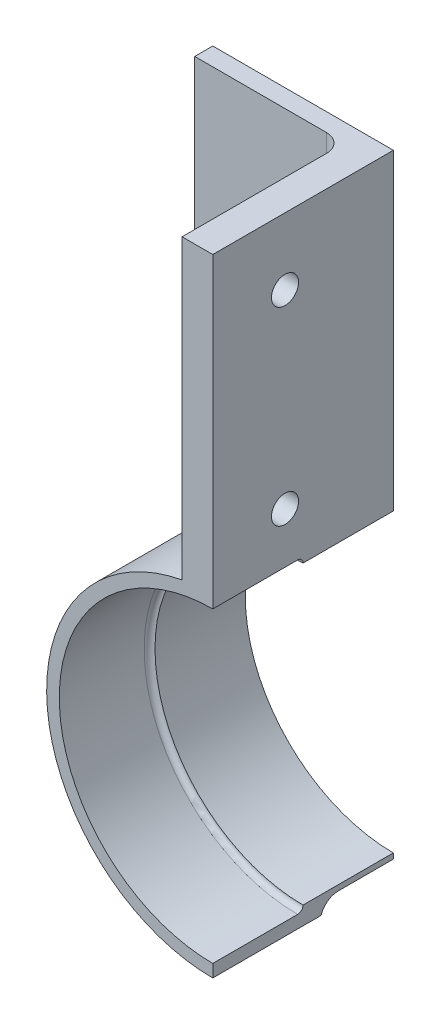
ISO-10303-21;
HEADER;
FILE_DESCRIPTION(('STEP AP214'),'2;1');
FILE_NAME('part.step','',(''),(''),'','','');
FILE_SCHEMA(('AUTOMOTIVE_DESIGN { 1 0 10303 214 1 1 1 1 }'));
ENDSEC;
DATA;
#1=APPLICATION_CONTEXT('core data for automotive mechanical design processes');
#2=APPLICATION_PROTOCOL_DEFINITION('international standard','automotive_design',2000,#1);
#3=PRODUCT_CONTEXT('',#1,'mechanical');
#4=PRODUCT('Part','Part','',(#3));
#5=PRODUCT_RELATED_PRODUCT_CATEGORY('part','',(#4));
#6=PRODUCT_DEFINITION_FORMATION('','',#4);
#7=PRODUCT_DEFINITION_CONTEXT('part definition',#1,'design');
#8=PRODUCT_DEFINITION('design','',#6,#7);
#9=PRODUCT_DEFINITION_SHAPE('','',#8);
#10=(LENGTH_UNIT() NAMED_UNIT(*) SI_UNIT(.MILLI.,.METRE.));
#11=(NAMED_UNIT(*) PLANE_ANGLE_UNIT() SI_UNIT($,.RADIAN.));
#12=(NAMED_UNIT(*) SI_UNIT($,.STERADIAN.) SOLID_ANGLE_UNIT());
#13=UNCERTAINTY_MEASURE_WITH_UNIT(LENGTH_MEASURE(1.E-05),#10,'distance_accuracy_value','');
#14=(GEOMETRIC_REPRESENTATION_CONTEXT(3) GLOBAL_UNCERTAINTY_ASSIGNED_CONTEXT((#13)) GLOBAL_UNIT_ASSIGNED_CONTEXT((#10,
#11,#12)) REPRESENTATION_CONTEXT('',''));
#15=CARTESIAN_POINT('',(0.,0.,0.));
#16=DIRECTION('',(0.,0.,1.));
#17=DIRECTION('',(1.,0.,0.));
#18=AXIS2_PLACEMENT_3D('',#15,#16,#17);
#19=CARTESIAN_POINT('',(25.4,20.828,12.7));
#20=DIRECTION('',(0.,0.,-1.));
#21=DIRECTION('',(-1.,0.,0.));
#22=AXIS2_PLACEMENT_3D('',#19,#20,#21);
#23=CYLINDRICAL_SURFACE('',#22,21.59);
#24=DIRECTION('',(0.,0.,-1.));
#25=VECTOR('',#24,1.);
#26=CARTESIAN_POINT('',(25.4,-0.762000000000009,12.7));
#27=LINE('',#26,#25);
#28=CARTESIAN_POINT('',(25.4,-0.762000000000009,7.73699442840096));
#29=VERTEX_POINT('',#28);
#30=CARTESIAN_POINT('',(25.4,-0.762000000000009,0.));
#31=VERTEX_POINT('',#30);
#32=EDGE_CURVE('E229',#29,#31,#27,.T.);
#33=ORIENTED_EDGE('',*,*,#32,.F.);
#34=CARTESIAN_POINT('',(25.4,20.828,7.73699442840096));
#35=DIRECTION('',(0.,0.,1.));
#36=DIRECTION('',(1.,0.,0.));
#37=AXIS2_PLACEMENT_3D('',#34,#35,#36);
#38=CIRCLE('',#37,21.59);
#39=CARTESIAN_POINT('',(21.082,41.9817934186755,7.73699442840096));
#40=VERTEX_POINT('',#39);
#41=EDGE_CURVE('E324',#29,#40,#38,.F.);
#42=ORIENTED_EDGE('',*,*,#41,.T.);
#43=DIRECTION('',(0.,0.,-1.));
#44=VECTOR('',#43,1.);
#45=CARTESIAN_POINT('',(21.082,41.9817934186755,25.4));
#46=LINE('',#45,#44);
#47=CARTESIAN_POINT('',(21.082,41.9817934186755,5.08));
#48=VERTEX_POINT('',#47);
#49=EDGE_CURVE('E203',#40,#48,#46,.T.);
#50=ORIENTED_EDGE('',*,*,#49,.T.);
#51=CARTESIAN_POINT('',(25.4,20.828,5.08));
#52=DIRECTION('',(0.,0.,1.));
#53=DIRECTION('',(1.,0.,0.));
#54=AXIS2_PLACEMENT_3D('',#51,#52,#53);
#55=CIRCLE('',#54,21.59);
#56=CARTESIAN_POINT('',(19.7147105614577,0.,5.08));
#57=VERTEX_POINT('',#56);
#58=EDGE_CURVE('E267',#48,#57,#55,.T.);
#59=ORIENTED_EDGE('',*,*,#58,.T.);
#60=DIRECTION('',(0.,0.,-1.));
#61=VECTOR('',#60,1.);
#62=CARTESIAN_POINT('',(19.7147105614577,0.,2.54));
#63=LINE('',#62,#61);
#64=CARTESIAN_POINT('',(19.7147105614577,0.,0.));
#65=VERTEX_POINT('',#64);
#66=EDGE_CURVE('E235',#57,#65,#63,.T.);
#67=ORIENTED_EDGE('',*,*,#66,.T.);
#68=CARTESIAN_POINT('',(25.4,20.828,0.));
#69=DIRECTION('',(0.,0.,1.));
#70=DIRECTION('',(1.,0.,0.));
#71=AXIS2_PLACEMENT_3D('',#68,#69,#70);
#72=CIRCLE('',#71,21.59);
#73=EDGE_CURVE('E220',#65,#31,#72,.T.);
#74=ORIENTED_EDGE('',*,*,#73,.T.);
#75=EDGE_LOOP('',(#33,#42,#50,#59,#67,#74));
#76=FACE_BOUND('',#75,.T.);
#77=ADVANCED_FACE('F45',(#76),#23,.T.);
#78=CARTESIAN_POINT('',(21.082,0.,25.4));
#79=DIRECTION('',(1.,0.,0.));
#80=DIRECTION('',(0.,1.,0.));
#81=AXIS2_PLACEMENT_3D('',#78,#79,#80);
#82=PLANE('',#81);
#83=CARTESIAN_POINT('',(21.082,76.2,15.24));
#84=DIRECTION('',(1.,0.,0.));
#85=DIRECTION('',(0.,1.,0.));
#86=AXIS2_PLACEMENT_3D('',#83,#84,#85);
#87=CIRCLE('',#86,1.905);
#88=CARTESIAN_POINT('',(21.082,78.105,15.24));
#89=VERTEX_POINT('',#88);
#90=EDGE_CURVE('E323',#89,#89,#87,.F.);
#91=ORIENTED_EDGE('',*,*,#90,.F.);
#92=EDGE_LOOP('',(#91));
#93=FACE_BOUND('',#92,.T.);
#94=CARTESIAN_POINT('',(21.082,49.53,15.24));
#95=DIRECTION('',(1.,0.,0.));
#96=DIRECTION('',(0.,1.,0.));
#97=AXIS2_PLACEMENT_3D('',#94,#95,#96);
#98=CIRCLE('',#97,1.905);
#99=CARTESIAN_POINT('',(21.082,51.435,15.24));
#100=VERTEX_POINT('',#99);
#101=EDGE_CURVE('E397',#100,#100,#98,.F.);
#102=ORIENTED_EDGE('',*,*,#101,.F.);
#103=EDGE_LOOP('',(#102));
#104=FACE_BOUND('',#103,.T.);
#105=ORIENTED_EDGE('',*,*,#49,.F.);
#106=CARTESIAN_POINT('',(21.082,41.9817934186755,7.73699442840096));
#107=CARTESIAN_POINT('',(21.082,41.9817855493863,7.80741743228671));
#108=CARTESIAN_POINT('',(21.082,41.9847825131222,7.87783667536149));
#109=CARTESIAN_POINT('',(21.082,41.9967254211523,8.01816261184856));
#110=CARTESIAN_POINT('',(21.082,42.0056708192554,8.08806935172362));
#111=CARTESIAN_POINT('',(21.082,42.0294364237545,8.22679951875907));
#112=CARTESIAN_POINT('',(21.082,42.0442499443651,8.29562408642032));
#113=CARTESIAN_POINT('',(21.082,42.0796175446205,8.43176193820108));
#114=CARTESIAN_POINT('',(21.082,42.1001716014813,8.49907522831764));
#115=CARTESIAN_POINT('',(21.082,42.1702384172231,8.69806515176501));
#116=CARTESIAN_POINT('',(21.082,42.2281724222198,8.82688794258578));
#117=CARTESIAN_POINT('',(21.082,42.3646120641149,9.07301314231368));
#118=CARTESIAN_POINT('',(21.082,42.4431155999665,9.19031672615323));
#119=CARTESIAN_POINT('',(21.082,42.619196136835,9.41144554330852));
#120=CARTESIAN_POINT('',(21.082,42.7169467039284,9.5151326340465));
#121=CARTESIAN_POINT('',(21.082,42.9282137310594,9.70501179650435));
#122=CARTESIAN_POINT('',(21.082,43.0417328884036,9.79120086886696));
#123=CARTESIAN_POINT('',(21.082,43.2597529342116,9.9301448214924));
#124=CARTESIAN_POINT('',(21.082,43.3622189865194,9.98612379010968));
#125=CARTESIAN_POINT('',(21.082,43.573546358283,10.0838781525407));
#126=CARTESIAN_POINT('',(21.082,43.6823987647697,10.1256728141703));
#127=CARTESIAN_POINT('',(21.082,43.7935894764319,10.16));
#128=B_SPLINE_CURVE_WITH_KNOTS('',3,(#106,#107,#108,#109,#110,#111,#112,#113,#114,#115,#116,
#117,#118,#119,#120,#121,#122,#123,#124,#125,#126,#127),.UNSPECIFIED.,.F.,.F.,(4,2,2,2,2,2,2,2,
2,2,4),(0.,0.211198618501135,0.422377847214661,0.633317159879507,0.844255635345321,
1.26584369057153,1.68738870003191,2.11292527642232,2.5385347330991,2.88780096457167,
3.23659083944982),.UNSPECIFIED.);
#129=CARTESIAN_POINT('',(21.082,43.7935894764319,10.16));
#130=VERTEX_POINT('',#129);
#131=EDGE_CURVE('E173',#40,#130,#128,.T.);
#132=ORIENTED_EDGE('',*,*,#131,.T.);
#133=DIRECTION('',(0.,0.,-1.));
#134=VECTOR('',#133,1.);
#135=CARTESIAN_POINT('',(21.082,43.7935894764319,25.4));
#136=LINE('',#135,#134);
#137=CARTESIAN_POINT('',(21.082,43.7935894764319,25.4));
#138=VERTEX_POINT('',#137);
#139=EDGE_CURVE('E153',#138,#130,#136,.T.);
#140=ORIENTED_EDGE('',*,*,#139,.F.);
#141=DIRECTION('',(0.,-1.,0.));
#142=VECTOR('',#141,1.);
#143=CARTESIAN_POINT('',(21.082,0.,25.4));
#144=LINE('',#143,#142);
#145=CARTESIAN_POINT('',(21.082,85.598,25.4));
#146=VERTEX_POINT('',#145);
#147=EDGE_CURVE('E170',#146,#138,#144,.T.);
#148=ORIENTED_EDGE('',*,*,#147,.F.);
#149=DIRECTION('',(0.,0.,-1.));
#150=VECTOR('',#149,1.);
#151=CARTESIAN_POINT('',(21.082,85.598,25.4));
#152=LINE('',#151,#150);
#153=CARTESIAN_POINT('',(21.082,85.598,5.08));
#154=VERTEX_POINT('',#153);
#155=EDGE_CURVE('E193',#146,#154,#152,.T.);
#156=ORIENTED_EDGE('',*,*,#155,.T.);
#157=DIRECTION('',(0.,-1.,0.));
#158=VECTOR('',#157,1.);
#159=CARTESIAN_POINT('',(21.082,0.,5.08));
#160=LINE('',#159,#158);
#161=EDGE_CURVE('E277',#154,#48,#160,.T.);
#162=ORIENTED_EDGE('',*,*,#161,.T.);
#163=EDGE_LOOP('',(#105,#132,#140,#148,#156,#162));
#164=FACE_BOUND('',#163,.T.);
#165=ADVANCED_FACE('F168',(#93,#104,#164),#82,.F.);
#166=CARTESIAN_POINT('',(0.,85.598,2.54));
#167=DIRECTION('',(0.,1.,0.));
#168=DIRECTION('',(0.,0.,1.));
#169=AXIS2_PLACEMENT_3D('',#166,#167,#168);
#170=PLANE('',#169);
#171=DIRECTION('',(1.,0.,0.));
#172=VECTOR('',#171,1.);
#173=CARTESIAN_POINT('',(0.,85.598,0.));
#174=LINE('',#173,#172);
#175=CARTESIAN_POINT('',(0.,85.598,0.));
#176=VERTEX_POINT('',#175);
#177=CARTESIAN_POINT('',(25.4,85.598,0.));
#178=VERTEX_POINT('',#177);
#179=EDGE_CURVE('E239',#176,#178,#174,.T.);
#180=ORIENTED_EDGE('',*,*,#179,.F.);
#181=DIRECTION('',(0.,0.,-1.));
#182=VECTOR('',#181,1.);
#183=CARTESIAN_POINT('',(0.,85.598,2.54));
#184=LINE('',#183,#182);
#185=CARTESIAN_POINT('',(0.,85.598,2.54));
#186=VERTEX_POINT('',#185);
#187=EDGE_CURVE('E264',#186,#176,#184,.T.);
#188=ORIENTED_EDGE('',*,*,#187,.F.);
#189=DIRECTION('',(1.,0.,0.));
#190=VECTOR('',#189,1.);
#191=CARTESIAN_POINT('',(0.,85.598,2.54));
#192=LINE('',#191,#190);
#193=CARTESIAN_POINT('',(18.542,85.598,2.54));
#194=VERTEX_POINT('',#193);
#195=EDGE_CURVE('E240',#186,#194,#192,.T.);
#196=ORIENTED_EDGE('',*,*,#195,.T.);
#197=CARTESIAN_POINT('',(18.542,85.598,5.08));
#198=DIRECTION('',(0.,1.,0.));
#199=DIRECTION('',(0.,0.,1.));
#200=AXIS2_PLACEMENT_3D('',#197,#198,#199);
#201=CIRCLE('',#200,2.54);
#202=EDGE_CURVE('E290',#194,#154,#201,.F.);
#203=ORIENTED_EDGE('',*,*,#202,.T.);
#204=ORIENTED_EDGE('',*,*,#155,.F.);
#205=DIRECTION('',(1.,0.,0.));
#206=VECTOR('',#205,1.);
#207=CARTESIAN_POINT('',(0.,85.598,25.4));
#208=LINE('',#207,#206);
#209=CARTESIAN_POINT('',(25.4,85.598,25.4));
#210=VERTEX_POINT('',#209);
#211=EDGE_CURVE('E179',#146,#210,#208,.T.);
#212=ORIENTED_EDGE('',*,*,#211,.T.);
#213=DIRECTION('',(0.,0.,-1.));
#214=VECTOR('',#213,1.);
#215=CARTESIAN_POINT('',(25.4,85.598,25.4));
#216=LINE('',#215,#214);
#217=EDGE_CURVE('E196',#210,#178,#216,.T.);
#218=ORIENTED_EDGE('',*,*,#217,.T.);
#219=EDGE_LOOP('',(#180,#188,#196,#203,#204,#212,#218));
#220=FACE_BOUND('',#219,.T.);
#221=ADVANCED_FACE('F307',(#220),#170,.T.);
#222=CARTESIAN_POINT('',(0.,0.,2.54));
#223=DIRECTION('',(-1.,0.,0.));
#224=DIRECTION('',(0.,0.,1.));
#225=AXIS2_PLACEMENT_3D('',#222,#223,#224);
#226=PLANE('',#225);
#227=DIRECTION('',(0.,1.,0.));
#228=VECTOR('',#227,1.);
#229=CARTESIAN_POINT('',(0.,0.,0.));
#230=LINE('',#229,#228);
#231=CARTESIAN_POINT('',(0.,0.,0.));
#232=VERTEX_POINT('',#231);
#233=EDGE_CURVE('E255',#232,#176,#230,.T.);
#234=ORIENTED_EDGE('',*,*,#233,.F.);
#235=DIRECTION('',(0.,0.,-1.));
#236=VECTOR('',#235,1.);
#237=CARTESIAN_POINT('',(0.,0.,2.54));
#238=LINE('',#237,#236);
#239=CARTESIAN_POINT('',(0.,0.,2.54));
#240=VERTEX_POINT('',#239);
#241=EDGE_CURVE('E252',#240,#232,#238,.T.);
#242=ORIENTED_EDGE('',*,*,#241,.F.);
#243=DIRECTION('',(0.,1.,0.));
#244=VECTOR('',#243,1.);
#245=CARTESIAN_POINT('',(0.,0.,2.54));
#246=LINE('',#245,#244);
#247=EDGE_CURVE('E244',#240,#186,#246,.T.);
#248=ORIENTED_EDGE('',*,*,#247,.T.);
#249=ORIENTED_EDGE('',*,*,#187,.T.);
#250=EDGE_LOOP('',(#234,#242,#248,#249));
#251=FACE_BOUND('',#250,.T.);
#252=ADVANCED_FACE('F301',(#251),#226,.T.);
#253=CARTESIAN_POINT('',(0.,0.,2.54));
#254=DIRECTION('',(0.,-1.,0.));
#255=DIRECTION('',(1.,0.,0.));
#256=AXIS2_PLACEMENT_3D('',#253,#254,#255);
#257=PLANE('',#256);
#258=DIRECTION('',(-1.,0.,0.));
#259=VECTOR('',#258,1.);
#260=CARTESIAN_POINT('',(0.,0.,0.));
#261=LINE('',#260,#259);
#262=EDGE_CURVE('E245',#65,#232,#261,.T.);
#263=ORIENTED_EDGE('',*,*,#262,.F.);
#264=ORIENTED_EDGE('',*,*,#66,.F.);
#265=CARTESIAN_POINT('',(19.7147105614577,0.,5.08));
#266=CARTESIAN_POINT('',(19.7147245690757,0.,5.05630392436761));
#267=CARTESIAN_POINT('',(19.7134503378719,0.,5.03262722842789));
#268=CARTESIAN_POINT('',(19.7084571953394,0.,4.98558290300917));
#269=CARTESIAN_POINT('',(19.704743562085,0.,4.96221471712011));
#270=CARTESIAN_POINT('',(19.690309114386,0.,4.89366524760976));
#271=CARTESIAN_POINT('',(19.6762843799075,0.,4.84916258846783));
#272=CARTESIAN_POINT('',(19.63631238563,0.,4.75115552766877));
#273=CARTESIAN_POINT('',(19.6081324812302,0.,4.69859591034015));
#274=CARTESIAN_POINT('',(19.5438772904772,0.,4.59818417118208));
#275=CARTESIAN_POINT('',(19.5077422774997,0.,4.55037185963875));
#276=CARTESIAN_POINT('',(19.4314204318694,0.,4.46047597335129));
#277=CARTESIAN_POINT('',(19.391374985203,0.,4.4182696773962));
#278=CARTESIAN_POINT('',(19.3078951927639,0.,4.33731716176487));
#279=CARTESIAN_POINT('',(19.2644574127918,0.,4.29857453585264));
#280=CARTESIAN_POINT('',(19.1751176385546,0.,4.22393891920114));
#281=CARTESIAN_POINT('',(19.1292122173038,0.,4.18805007252599));
#282=CARTESIAN_POINT('',(19.0356312900543,0.,4.11872674104315));
#283=CARTESIAN_POINT('',(18.9879565941963,0.,4.08529115328198));
#284=CARTESIAN_POINT('',(18.8565671405761,0.,3.99724428542437));
#285=CARTESIAN_POINT('',(18.7715138448022,0.,3.94463322828385));
#286=CARTESIAN_POINT('',(18.5986390181553,0.,3.84413877503503));
#287=CARTESIAN_POINT('',(18.5108159662393,0.,3.79625803844646));
#288=CARTESIAN_POINT('',(18.3330043921364,0.,3.70432157676334));
#289=CARTESIAN_POINT('',(18.2430123489932,0.,3.66027269280755));
#290=CARTESIAN_POINT('',(18.0614619421676,0.,3.57551784525944));
#291=CARTESIAN_POINT('',(17.9699033349601,0.,3.53481240722299));
#292=CARTESIAN_POINT('',(17.6922680518208,0.,3.41662945324412));
#293=CARTESIAN_POINT('',(17.5042845069713,0.,3.34361487647995));
#294=CARTESIAN_POINT('',(17.1249598239252,0.,3.20763315724901));
#295=CARTESIAN_POINT('',(16.9336218954884,0.,3.14465693561586));
#296=CARTESIAN_POINT('',(16.5963481663653,0.,3.04246165844155));
#297=CARTESIAN_POINT('',(16.4510164316561,0.,3.00123870677421));
#298=CARTESIAN_POINT('',(16.1590206524128,0.,2.92382613499503));
#299=CARTESIAN_POINT('',(16.0123565377716,0.,2.88763678139377));
#300=CARTESIAN_POINT('',(15.5705225224075,0.,2.78656267496346));
#301=CARTESIAN_POINT('',(15.2735732943189,0.,2.72919068008218));
#302=CARTESIAN_POINT('',(14.8295617708456,0.,2.65968452502562));
#303=CARTESIAN_POINT('',(14.6837187022081,0.,2.63943866522954));
#304=CARTESIAN_POINT('',(14.3913910896784,0.,2.60426368225));
#305=CARTESIAN_POINT('',(14.244906589541,0.,2.5893342019618));
#306=CARTESIAN_POINT('',(13.951489431439,0.,2.56510853979199));
#307=CARTESIAN_POINT('',(13.8045568419101,0.,2.5558115371181));
#308=CARTESIAN_POINT('',(13.510403056085,0.,2.54326396334534));
#309=CARTESIAN_POINT('',(13.3631818017805,0.,2.54001476706395));
#310=CARTESIAN_POINT('',(13.2159400855051,0.,2.54));
#311=B_SPLINE_CURVE_WITH_KNOTS('',3,(#265,#266,#267,#268,#269,#270,#271,#272,#273,#274,#275,
#276,#277,#278,#279,#280,#281,#282,#283,#284,#285,#286,#287,#288,#289,#290,#291,#292,#293,#294,
#295,#296,#297,#298,#299,#300,#301,#302,#303,#304,#305,#306,#307,#308,#309,#310),.UNSPECIFIED.,
.F.,.F.,(4,2,2,2,2,2,2,2,2,2,2,2,2,2,2,2,2,2,2,2,2,2,4),(0.,0.0710199008333669,
0.141886641573953,0.28103990715306,0.458947738390683,0.63823984136352,0.812523421438053,
0.986985781879341,1.16169702596689,1.33632923462825,1.63613571761551,1.93610981229845,
2.23660891678721,2.5371551666567,3.14177548100189,3.74584580646395,4.19894690612947,
4.65207198671461,5.55851712704861,6.00017039379687,6.44179398880446,6.88335321276481,
7.32501280191366),.UNSPECIFIED.);
#312=CARTESIAN_POINT('',(13.2159400855051,0.,2.54));
#313=VERTEX_POINT('',#312);
#314=EDGE_CURVE('E281',#57,#313,#311,.T.);
#315=ORIENTED_EDGE('',*,*,#314,.T.);
#316=DIRECTION('',(-1.,0.,0.));
#317=VECTOR('',#316,1.);
#318=CARTESIAN_POINT('',(0.,0.,2.54));
#319=LINE('',#318,#317);
#320=EDGE_CURVE('E249',#313,#240,#319,.T.);
#321=ORIENTED_EDGE('',*,*,#320,.T.);
#322=ORIENTED_EDGE('',*,*,#241,.T.);
#323=EDGE_LOOP('',(#263,#264,#315,#321,#322));
#324=FACE_BOUND('',#323,.T.);
#325=ADVANCED_FACE('F295',(#324),#257,.T.);
#326=CARTESIAN_POINT('',(0.,0.,2.54));
#327=DIRECTION('',(0.,0.,1.));
#328=DIRECTION('',(1.,0.,0.));
#329=AXIS2_PLACEMENT_3D('',#326,#327,#328);
#330=PLANE('',#329);
#331=ORIENTED_EDGE('',*,*,#320,.F.);
#332=CARTESIAN_POINT('',(25.4,20.828,2.54));
#333=DIRECTION('',(0.,0.,1.));
#334=DIRECTION('',(1.,0.,0.));
#335=AXIS2_PLACEMENT_3D('',#332,#333,#334);
#336=CIRCLE('',#335,24.13);
#337=CARTESIAN_POINT('',(18.542,43.9629245946469,2.54));
#338=VERTEX_POINT('',#337);
#339=EDGE_CURVE('E274',#313,#338,#336,.F.);
#340=ORIENTED_EDGE('',*,*,#339,.T.);
#341=DIRECTION('',(0.,-1.,0.));
#342=VECTOR('',#341,1.);
#343=CARTESIAN_POINT('',(18.542,0.,2.54));
#344=LINE('',#343,#342);
#345=EDGE_CURVE('E271',#338,#194,#344,.F.);
#346=ORIENTED_EDGE('',*,*,#345,.T.);
#347=ORIENTED_EDGE('',*,*,#195,.F.);
#348=ORIENTED_EDGE('',*,*,#247,.F.);
#349=EDGE_LOOP('',(#331,#340,#346,#347,#348));
#350=FACE_BOUND('',#349,.T.);
#351=ADVANCED_FACE('F300',(#350),#330,.T.);
#352=CARTESIAN_POINT('',(0.,0.,0.));
#353=DIRECTION('',(0.,0.,1.));
#354=DIRECTION('',(1.,0.,0.));
#355=AXIS2_PLACEMENT_3D('',#352,#353,#354);
#356=PLANE('',#355);
#357=ORIENTED_EDGE('',*,*,#179,.T.);
#358=DIRECTION('',(0.,-1.,0.));
#359=VECTOR('',#358,1.);
#360=CARTESIAN_POINT('',(25.4,0.,0.));
#361=LINE('',#360,#359);
#362=CARTESIAN_POINT('',(25.4,41.656,0.));
#363=VERTEX_POINT('',#362);
#364=EDGE_CURVE('E216',#178,#363,#361,.T.);
#365=ORIENTED_EDGE('',*,*,#364,.T.);
#366=CARTESIAN_POINT('',(25.4,20.828,0.));
#367=DIRECTION('',(0.,0.,1.));
#368=DIRECTION('',(1.,0.,0.));
#369=AXIS2_PLACEMENT_3D('',#366,#367,#368);
#370=CIRCLE('',#369,20.828);
#371=CARTESIAN_POINT('',(25.4,0.,0.));
#372=VERTEX_POINT('',#371);
#373=EDGE_CURVE('E206',#363,#372,#370,.T.);
#374=ORIENTED_EDGE('',*,*,#373,.T.);
#375=DIRECTION('',(0.,-1.,0.));
#376=VECTOR('',#375,1.);
#377=CARTESIAN_POINT('',(25.4,0.,0.));
#378=LINE('',#377,#376);
#379=EDGE_CURVE('E212',#372,#31,#378,.T.);
#380=ORIENTED_EDGE('',*,*,#379,.T.);
#381=ORIENTED_EDGE('',*,*,#73,.F.);
#382=ORIENTED_EDGE('',*,*,#262,.T.);
#383=ORIENTED_EDGE('',*,*,#233,.T.);
#384=EDGE_LOOP('',(#357,#365,#374,#380,#381,#382,#383));
#385=FACE_BOUND('',#384,.T.);
#386=ADVANCED_FACE('F303',(#385),#356,.F.);
#387=CARTESIAN_POINT('',(25.4,20.828,12.7));
#388=DIRECTION('',(0.,0.,-1.));
#389=DIRECTION('',(-1.,0.,0.));
#390=AXIS2_PLACEMENT_3D('',#387,#388,#389);
#391=CYLINDRICAL_SURFACE('',#390,20.828);
#392=ORIENTED_EDGE('',*,*,#373,.F.);
#393=DIRECTION('',(0.,0.,-1.));
#394=VECTOR('',#393,1.);
#395=CARTESIAN_POINT('',(25.4,41.656,12.7));
#396=LINE('',#395,#394);
#397=CARTESIAN_POINT('',(25.4,41.656,12.7));
#398=VERTEX_POINT('',#397);
#399=EDGE_CURVE('E232',#398,#363,#396,.T.);
#400=ORIENTED_EDGE('',*,*,#399,.F.);
#401=CARTESIAN_POINT('',(25.4,20.828,12.7));
#402=DIRECTION('',(0.,0.,1.));
#403=DIRECTION('',(1.,0.,0.));
#404=AXIS2_PLACEMENT_3D('',#401,#402,#403);
#405=CIRCLE('',#404,20.828);
#406=CARTESIAN_POINT('',(25.4,0.,12.7));
#407=VERTEX_POINT('',#406);
#408=EDGE_CURVE('E207',#398,#407,#405,.T.);
#409=ORIENTED_EDGE('',*,*,#408,.T.);
#410=DIRECTION('',(0.,0.,-1.));
#411=VECTOR('',#410,1.);
#412=CARTESIAN_POINT('',(25.4,0.,12.7));
#413=LINE('',#412,#411);
#414=EDGE_CURVE('E211',#407,#372,#413,.T.);
#415=ORIENTED_EDGE('',*,*,#414,.T.);
#416=EDGE_LOOP('',(#392,#400,#409,#415));
#417=FACE_BOUND('',#416,.T.);
#418=ADVANCED_FACE('F354',(#417),#391,.F.);
#419=CARTESIAN_POINT('',(25.4,0.,12.7));
#420=DIRECTION('',(1.,0.,0.));
#421=DIRECTION('',(0.,1.,0.));
#422=AXIS2_PLACEMENT_3D('',#419,#420,#421);
#423=PLANE('',#422);
#424=CARTESIAN_POINT('',(25.4,76.2,15.24));
#425=DIRECTION('',(1.,0.,0.));
#426=DIRECTION('',(0.,0.,-1.));
#427=AXIS2_PLACEMENT_3D('',#424,#425,#426);
#428=CIRCLE('',#427,1.905);
#429=CARTESIAN_POINT('',(25.4,76.2,13.335));
#430=VERTEX_POINT('',#429);
#431=EDGE_CURVE('E401',#430,#430,#428,.T.);
#432=ORIENTED_EDGE('',*,*,#431,.F.);
#433=EDGE_LOOP('',(#432));
#434=FACE_BOUND('',#433,.T.);
#435=CARTESIAN_POINT('',(25.4,49.53,15.24));
#436=DIRECTION('',(1.,0.,0.));
#437=DIRECTION('',(0.,0.,-1.));
#438=AXIS2_PLACEMENT_3D('',#435,#436,#437);
#439=CIRCLE('',#438,1.905);
#440=CARTESIAN_POINT('',(25.4,49.53,13.335));
#441=VERTEX_POINT('',#440);
#442=EDGE_CURVE('E402',#441,#441,#439,.T.);
#443=ORIENTED_EDGE('',*,*,#442,.F.);
#444=EDGE_LOOP('',(#443));
#445=FACE_BOUND('',#444,.T.);
#446=ORIENTED_EDGE('',*,*,#364,.F.);
#447=ORIENTED_EDGE('',*,*,#217,.F.);
#448=DIRECTION('',(0.,-1.,0.));
#449=VECTOR('',#448,1.);
#450=CARTESIAN_POINT('',(25.4,0.,25.4));
#451=LINE('',#450,#449);
#452=CARTESIAN_POINT('',(25.4,42.418,25.4));
#453=VERTEX_POINT('',#452);
#454=EDGE_CURVE('E184',#210,#453,#451,.T.);
#455=ORIENTED_EDGE('',*,*,#454,.T.);
#456=DIRECTION('',(0.,0.,-1.));
#457=VECTOR('',#456,1.);
#458=CARTESIAN_POINT('',(25.4,42.418,25.4));
#459=LINE('',#458,#457);
#460=CARTESIAN_POINT('',(25.4,42.418,13.462));
#461=VERTEX_POINT('',#460);
#462=EDGE_CURVE('E200',#453,#461,#459,.T.);
#463=ORIENTED_EDGE('',*,*,#462,.T.);
#464=CARTESIAN_POINT('',(25.4,41.656,13.462));
#465=DIRECTION('',(1.,0.,0.));
#466=DIRECTION('',(0.,1.,0.));
#467=AXIS2_PLACEMENT_3D('',#464,#465,#466);
#468=CIRCLE('',#467,0.762);
#469=EDGE_CURVE('E11',#461,#398,#468,.F.);
#470=ORIENTED_EDGE('',*,*,#469,.T.);
#471=ORIENTED_EDGE('',*,*,#399,.T.);
#472=EDGE_LOOP('',(#446,#447,#455,#463,#470,#471));
#473=FACE_BOUND('',#472,.T.);
#474=ADVANCED_FACE('F348',(#434,#445,#473),#423,.T.);
#475=CARTESIAN_POINT('',(25.4,0.,12.7));
#476=DIRECTION('',(1.,0.,0.));
#477=DIRECTION('',(0.,1.,0.));
#478=AXIS2_PLACEMENT_3D('',#475,#476,#477);
#479=PLANE('',#478);
#480=ORIENTED_EDGE('',*,*,#379,.F.);
#481=ORIENTED_EDGE('',*,*,#414,.F.);
#482=CARTESIAN_POINT('',(25.4,0.,13.462));
#483=DIRECTION('',(1.,0.,0.));
#484=DIRECTION('',(0.,1.,0.));
#485=AXIS2_PLACEMENT_3D('',#482,#483,#484);
#486=CIRCLE('',#485,0.762);
#487=CARTESIAN_POINT('',(25.4,-0.762000000000009,13.462));
#488=VERTEX_POINT('',#487);
#489=EDGE_CURVE('E54',#407,#488,#486,.F.);
#490=ORIENTED_EDGE('',*,*,#489,.T.);
#491=DIRECTION('',(0.,0.,-1.));
#492=VECTOR('',#491,1.);
#493=CARTESIAN_POINT('',(25.4,-0.762000000000009,25.4));
#494=LINE('',#493,#492);
#495=CARTESIAN_POINT('',(25.4,-0.762000000000009,25.4));
#496=VERTEX_POINT('',#495);
#497=EDGE_CURVE('E385',#496,#488,#494,.T.);
#498=ORIENTED_EDGE('',*,*,#497,.F.);
#499=DIRECTION('',(0.,-1.,0.));
#500=VECTOR('',#499,1.);
#501=CARTESIAN_POINT('',(25.4,0.,25.4));
#502=LINE('',#501,#500);
#503=CARTESIAN_POINT('',(25.4,-2.54,25.4));
#504=VERTEX_POINT('',#503);
#505=EDGE_CURVE('E162',#496,#504,#502,.T.);
#506=ORIENTED_EDGE('',*,*,#505,.T.);
#507=DIRECTION('',(0.,0.,-1.));
#508=VECTOR('',#507,1.);
#509=CARTESIAN_POINT('',(25.4,-2.54,25.4));
#510=LINE('',#509,#508);
#511=CARTESIAN_POINT('',(25.4,-2.54,10.16));
#512=VERTEX_POINT('',#511);
#513=EDGE_CURVE('E156',#504,#512,#510,.T.);
#514=ORIENTED_EDGE('',*,*,#513,.T.);
#515=CARTESIAN_POINT('',(25.4,-3.30200000000001,7.73699442840096));
#516=DIRECTION('',(1.,0.,0.));
#517=DIRECTION('',(0.,1.,0.));
#518=AXIS2_PLACEMENT_3D('',#515,#516,#517);
#519=CIRCLE('',#518,2.54);
#520=EDGE_CURVE('E334',#512,#29,#519,.F.);
#521=ORIENTED_EDGE('',*,*,#520,.T.);
#522=ORIENTED_EDGE('',*,*,#32,.T.);
#523=EDGE_LOOP('',(#480,#481,#490,#498,#506,#514,#521,#522));
#524=FACE_BOUND('',#523,.T.);
#525=ADVANCED_FACE('F345',(#524),#479,.T.);
#526=CARTESIAN_POINT('',(25.4,20.828,25.4));
#527=DIRECTION('',(0.,0.,-1.));
#528=DIRECTION('',(-1.,0.,0.));
#529=AXIS2_PLACEMENT_3D('',#526,#527,#528);
#530=CYLINDRICAL_SURFACE('',#529,21.59);
#531=ORIENTED_EDGE('',*,*,#497,.T.);
#532=CARTESIAN_POINT('',(25.4,20.828,13.462));
#533=DIRECTION('',(0.,0.,1.));
#534=DIRECTION('',(1.,0.,0.));
#535=AXIS2_PLACEMENT_3D('',#532,#533,#534);
#536=CIRCLE('',#535,21.59);
#537=EDGE_CURVE('E61',#488,#461,#536,.F.);
#538=ORIENTED_EDGE('',*,*,#537,.T.);
#539=ORIENTED_EDGE('',*,*,#462,.F.);
#540=CARTESIAN_POINT('',(25.4,20.828,25.4));
#541=DIRECTION('',(0.,0.,1.));
#542=DIRECTION('',(1.,0.,0.));
#543=AXIS2_PLACEMENT_3D('',#540,#541,#542);
#544=CIRCLE('',#543,21.59);
#545=EDGE_CURVE('E181',#453,#496,#544,.T.);
#546=ORIENTED_EDGE('',*,*,#545,.T.);
#547=EDGE_LOOP('',(#531,#538,#539,#546));
#548=FACE_BOUND('',#547,.T.);
#549=ADVANCED_FACE('F343',(#548),#530,.F.);
#550=CARTESIAN_POINT('',(0.,0.,25.4));
#551=DIRECTION('',(0.,0.,1.));
#552=DIRECTION('',(1.,0.,0.));
#553=AXIS2_PLACEMENT_3D('',#550,#551,#552);
#554=PLANE('',#553);
#555=ORIENTED_EDGE('',*,*,#147,.T.);
#556=CARTESIAN_POINT('',(25.4,20.828,25.4));
#557=DIRECTION('',(0.,0.,1.));
#558=DIRECTION('',(1.,0.,0.));
#559=AXIS2_PLACEMENT_3D('',#556,#557,#558);
#560=CIRCLE('',#559,23.368);
#561=EDGE_CURVE('E149',#138,#504,#560,.T.);
#562=ORIENTED_EDGE('',*,*,#561,.T.);
#563=ORIENTED_EDGE('',*,*,#505,.F.);
#564=ORIENTED_EDGE('',*,*,#545,.F.);
#565=ORIENTED_EDGE('',*,*,#454,.F.);
#566=ORIENTED_EDGE('',*,*,#211,.F.);
#567=EDGE_LOOP('',(#555,#562,#563,#564,#565,#566));
#568=FACE_BOUND('',#567,.T.);
#569=ADVANCED_FACE('F176',(#568),#554,.T.);
#570=CARTESIAN_POINT('',(25.4,20.828,25.4));
#571=DIRECTION('',(0.,0.,-1.));
#572=DIRECTION('',(-1.,0.,0.));
#573=AXIS2_PLACEMENT_3D('',#570,#571,#572);
#574=CYLINDRICAL_SURFACE('',#573,23.368);
#575=CARTESIAN_POINT('',(25.4,20.828,10.16));
#576=DIRECTION('',(0.,0.,1.));
#577=DIRECTION('',(1.,0.,0.));
#578=AXIS2_PLACEMENT_3D('',#575,#576,#577);
#579=CIRCLE('',#578,23.368);
#580=EDGE_CURVE('E163',#130,#512,#579,.T.);
#581=ORIENTED_EDGE('',*,*,#580,.T.);
#582=ORIENTED_EDGE('',*,*,#513,.F.);
#583=ORIENTED_EDGE('',*,*,#561,.F.);
#584=ORIENTED_EDGE('',*,*,#139,.T.);
#585=EDGE_LOOP('',(#581,#582,#583,#584));
#586=FACE_BOUND('',#585,.T.);
#587=ADVANCED_FACE('F152',(#586),#574,.T.);
#588=CARTESIAN_POINT('',(18.542,0.,5.08));
#589=DIRECTION('',(0.,-1.,0.));
#590=DIRECTION('',(1.,0.,0.));
#591=AXIS2_PLACEMENT_3D('',#588,#589,#590);
#592=CYLINDRICAL_SURFACE('',#591,2.54);
#593=ORIENTED_EDGE('',*,*,#202,.F.);
#594=ORIENTED_EDGE('',*,*,#345,.F.);
#595=CARTESIAN_POINT('',(21.082,41.9817934186755,5.08));
#596=CARTESIAN_POINT('',(21.0820131474024,41.981781790478,5.01965116827999));
#597=CARTESIAN_POINT('',(21.0798496454996,41.9835491562669,4.9593115777802));
#598=CARTESIAN_POINT('',(21.0712705360735,41.9905527021619,4.83917343205825));
#599=CARTESIAN_POINT('',(21.0648574884057,41.9957867939693,4.7793745730768));
#600=CARTESIAN_POINT('',(21.0479390133141,42.0095868889027,4.66117711863565));
#601=CARTESIAN_POINT('',(21.037462219474,42.0181295786837,4.60277169591608));
#602=CARTESIAN_POINT('',(21.0126029547025,42.0383826027662,4.48737004851407));
#603=CARTESIAN_POINT('',(20.9982200721806,42.0500932708819,4.43037397302764));
#604=CARTESIAN_POINT('',(20.9496001261594,42.0896390212473,4.26231774671221));
#605=CARTESIAN_POINT('',(20.9098386159681,42.1219313703917,4.15383074717146));
#606=CARTESIAN_POINT('',(20.8176733987847,42.1965578433487,3.94602450485301));
#607=CARTESIAN_POINT('',(20.7652467157008,42.2389102148416,3.84672238250497));
#608=CARTESIAN_POINT('',(20.6312412891851,42.3467763154654,3.62811318456658));
#609=CARTESIAN_POINT('',(20.5457182193114,42.4153506553911,3.51272479171881));
#610=CARTESIAN_POINT('',(20.3607514634295,42.5628394863351,3.30136341188983));
#611=CARTESIAN_POINT('',(20.2612855358185,42.6417704851376,3.20542205690692));
#612=CARTESIAN_POINT('',(20.0258112748949,42.8275129084564,3.0115186323624));
#613=CARTESIAN_POINT('',(19.8868862599583,42.9363592327675,2.91905572106406));
#614=CARTESIAN_POINT('',(19.5982258881131,43.160735578474,2.7642199771412));
#615=CARTESIAN_POINT('',(19.4484858586775,43.2762684844106,2.70186024080032));
#616=CARTESIAN_POINT('',(19.1741131218494,43.4862807619929,2.61663080498415));
#617=CARTESIAN_POINT('',(19.0506888493176,43.5801754113305,2.58826264444269));
#618=CARTESIAN_POINT('',(18.8016455002904,43.7684526654633,2.55017759076967));
#619=CARTESIAN_POINT('',(18.6760315325645,43.8628338459721,2.54042196008685));
#620=CARTESIAN_POINT('',(18.547499063386,43.9588188495118,2.54000446260977));
#621=CARTESIAN_POINT('',(18.5447495665877,43.9608718335587,2.53999999792227));
#622=CARTESIAN_POINT('',(18.542,43.9629245946469,2.54));
#623=B_SPLINE_CURVE_WITH_KNOTS('',3,(#595,#596,#597,#598,#599,#600,#601,#602,#603,#604,#605,
#606,#607,#608,#609,#610,#611,#612,#613,#614,#615,#616,#617,#618,#619,#620,#621,#622),
.UNSPECIFIED.,.F.,.F.,(4,2,2,2,2,2,2,2,2,2,2,2,2,4),(0.,0.18096671126668,0.361824510181027,
0.541430460908172,0.721055344339483,1.0792233224743,1.43804600365724,1.91293236744367,
2.38858507655304,2.98323376812752,3.57814092696429,4.05007282115765,4.52102142536175,
4.53131560728989),.UNSPECIFIED.);
#624=EDGE_CURVE('E315',#48,#338,#623,.T.);
#625=ORIENTED_EDGE('',*,*,#624,.F.);
#626=ORIENTED_EDGE('',*,*,#161,.F.);
#627=EDGE_LOOP('',(#593,#594,#625,#626));
#628=FACE_BOUND('',#627,.T.);
#629=ADVANCED_FACE('F311',(#628),#592,.F.);
#630=CARTESIAN_POINT('',(25.4,20.828,5.08));
#631=DIRECTION('',(0.,0.,1.));
#632=DIRECTION('',(1.,0.,0.));
#633=AXIS2_PLACEMENT_3D('',#630,#631,#632);
#634=TOROIDAL_SURFACE('',#633,24.13,2.54);
#635=ORIENTED_EDGE('',*,*,#624,.T.);
#636=ORIENTED_EDGE('',*,*,#339,.F.);
#637=ORIENTED_EDGE('',*,*,#314,.F.);
#638=ORIENTED_EDGE('',*,*,#58,.F.);
#639=EDGE_LOOP('',(#635,#636,#637,#638));
#640=FACE_BOUND('',#639,.T.);
#641=ADVANCED_FACE('F292',(#640),#634,.F.);
#642=CARTESIAN_POINT('',(25.4,20.828,7.73699442840096));
#643=DIRECTION('',(0.,0.,1.));
#644=DIRECTION('',(1.,0.,0.));
#645=AXIS2_PLACEMENT_3D('',#642,#643,#644);
#646=TOROIDAL_SURFACE('',#645,24.13,2.54);
#647=ORIENTED_EDGE('',*,*,#131,.F.);
#648=ORIENTED_EDGE('',*,*,#41,.F.);
#649=ORIENTED_EDGE('',*,*,#520,.F.);
#650=ORIENTED_EDGE('',*,*,#580,.F.);
#651=EDGE_LOOP('',(#647,#648,#649,#650));
#652=FACE_BOUND('',#651,.T.);
#653=ADVANCED_FACE('F336',(#652),#646,.F.);
#654=CARTESIAN_POINT('',(25.4,20.828,13.462));
#655=DIRECTION('',(0.,0.,1.));
#656=DIRECTION('',(1.,0.,0.));
#657=AXIS2_PLACEMENT_3D('',#654,#655,#656);
#658=TOROIDAL_SURFACE('',#657,20.828,0.762);
#659=ORIENTED_EDGE('',*,*,#469,.F.);
#660=ORIENTED_EDGE('',*,*,#537,.F.);
#661=ORIENTED_EDGE('',*,*,#489,.F.);
#662=ORIENTED_EDGE('',*,*,#408,.F.);
#663=EDGE_LOOP('',(#659,#660,#661,#662));
#664=FACE_BOUND('',#663,.T.);
#665=ADVANCED_FACE('F47',(#664),#658,.F.);
#666=CARTESIAN_POINT('',(25.4,49.53,15.24));
#667=DIRECTION('',(-1.,0.,0.));
#668=DIRECTION('',(0.,0.,1.));
#669=AXIS2_PLACEMENT_3D('',#666,#667,#668);
#670=CYLINDRICAL_SURFACE('',#669,1.905);
#671=ORIENTED_EDGE('',*,*,#442,.T.);
#672=EDGE_LOOP('',(#671));
#673=FACE_BOUND('',#672,.T.);
#674=ORIENTED_EDGE('',*,*,#101,.T.);
#675=EDGE_LOOP('',(#674));
#676=FACE_BOUND('',#675,.T.);
#677=ADVANCED_FACE('F415',(#673,#676),#670,.F.);
#678=CARTESIAN_POINT('',(25.4,76.2,15.24));
#679=DIRECTION('',(-1.,0.,0.));
#680=DIRECTION('',(0.,0.,1.));
#681=AXIS2_PLACEMENT_3D('',#678,#679,#680);
#682=CYLINDRICAL_SURFACE('',#681,1.905);
#683=ORIENTED_EDGE('',*,*,#431,.T.);
#684=EDGE_LOOP('',(#683));
#685=FACE_BOUND('',#684,.T.);
#686=ORIENTED_EDGE('',*,*,#90,.T.);
#687=EDGE_LOOP('',(#686));
#688=FACE_BOUND('',#687,.T.);
#689=ADVANCED_FACE('F410',(#685,#688),#682,.F.);
#690=CLOSED_SHELL('',(#77,#165,#221,#252,#325,#351,#386,#418,#474,#525,#549,#569,#587,#629,#641,
#653,#665,#677,#689));
#691=MANIFOLD_SOLID_BREP('B2',#690);
#692=ADVANCED_BREP_SHAPE_REPRESENTATION('',(#18,#691),#14);
#693=SHAPE_DEFINITION_REPRESENTATION(#9,#692);
ENDSEC;
END-ISO-10303-21;
